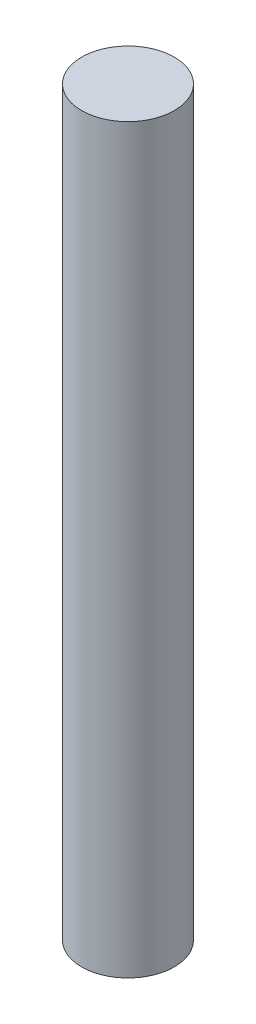
ISO-10303-21;
HEADER;
FILE_DESCRIPTION(('STEP AP214'),'2;1');
FILE_NAME('part.step','',(''),(''),'','','');
FILE_SCHEMA(('AUTOMOTIVE_DESIGN { 1 0 10303 214 1 1 1 1 }'));
ENDSEC;
DATA;
#1=APPLICATION_CONTEXT('core data for automotive mechanical design processes');
#2=APPLICATION_PROTOCOL_DEFINITION('international standard','automotive_design',2000,#1);
#3=PRODUCT_CONTEXT('',#1,'mechanical');
#4=PRODUCT('Part','Part','',(#3));
#5=PRODUCT_RELATED_PRODUCT_CATEGORY('part','',(#4));
#6=PRODUCT_DEFINITION_FORMATION('','',#4);
#7=PRODUCT_DEFINITION_CONTEXT('part definition',#1,'design');
#8=PRODUCT_DEFINITION('design','',#6,#7);
#9=PRODUCT_DEFINITION_SHAPE('','',#8);
#10=(LENGTH_UNIT() NAMED_UNIT(*) SI_UNIT(.MILLI.,.METRE.));
#11=(NAMED_UNIT(*) PLANE_ANGLE_UNIT() SI_UNIT($,.RADIAN.));
#12=(NAMED_UNIT(*) SI_UNIT($,.STERADIAN.) SOLID_ANGLE_UNIT());
#13=UNCERTAINTY_MEASURE_WITH_UNIT(LENGTH_MEASURE(1.E-05),#10,'distance_accuracy_value','');
#14=(GEOMETRIC_REPRESENTATION_CONTEXT(3) GLOBAL_UNCERTAINTY_ASSIGNED_CONTEXT((#13)) GLOBAL_UNIT_ASSIGNED_CONTEXT((#10,
#11,#12)) REPRESENTATION_CONTEXT('',''));
#15=CARTESIAN_POINT('',(0.,0.,0.));
#16=DIRECTION('',(0.,0.,1.));
#17=DIRECTION('',(1.,0.,0.));
#18=AXIS2_PLACEMENT_3D('',#15,#16,#17);
#19=CARTESIAN_POINT('',(0.,38.1,0.));
#20=DIRECTION('',(0.,-1.,0.));
#21=DIRECTION('',(0.,0.,-1.));
#22=AXIS2_PLACEMENT_3D('',#19,#20,#21);
#23=CYLINDRICAL_SURFACE('',#22,4.7625);
#24=CARTESIAN_POINT('',(0.,38.1,0.));
#25=DIRECTION('',(0.,1.,0.));
#26=DIRECTION('',(0.,0.,1.));
#27=AXIS2_PLACEMENT_3D('',#24,#25,#26);
#28=CIRCLE('',#27,4.7625);
#29=CARTESIAN_POINT('',(0.,38.1,4.7625));
#30=VERTEX_POINT('',#29);
#31=EDGE_CURVE('E10',#30,#30,#28,.T.);
#32=ORIENTED_EDGE('',*,*,#31,.F.);
#33=EDGE_LOOP('',(#32));
#34=FACE_BOUND('',#33,.T.);
#35=CARTESIAN_POINT('',(0.,-38.1,0.));
#36=DIRECTION('',(0.,1.,0.));
#37=DIRECTION('',(0.,0.,1.));
#38=AXIS2_PLACEMENT_3D('',#35,#36,#37);
#39=CIRCLE('',#38,4.7625);
#40=CARTESIAN_POINT('',(0.,-38.1,4.7625));
#41=VERTEX_POINT('',#40);
#42=EDGE_CURVE('E36',#41,#41,#39,.T.);
#43=ORIENTED_EDGE('',*,*,#42,.T.);
#44=EDGE_LOOP('',(#43));
#45=FACE_BOUND('',#44,.T.);
#46=ADVANCED_FACE('F33',(#34,#45),#23,.T.);
#47=CARTESIAN_POINT('',(0.,38.1,0.));
#48=DIRECTION('',(0.,1.,0.));
#49=DIRECTION('',(0.,0.,1.));
#50=AXIS2_PLACEMENT_3D('',#47,#48,#49);
#51=PLANE('',#50);
#52=ORIENTED_EDGE('',*,*,#31,.T.);
#53=EDGE_LOOP('',(#52));
#54=FACE_BOUND('',#53,.T.);
#55=ADVANCED_FACE('F62',(#54),#51,.T.);
#56=CARTESIAN_POINT('',(0.,-38.1,0.));
#57=DIRECTION('',(0.,1.,0.));
#58=DIRECTION('',(0.,0.,1.));
#59=AXIS2_PLACEMENT_3D('',#56,#57,#58);
#60=PLANE('',#59);
#61=CARTESIAN_POINT('',(0.,-38.1,0.));
#62=DIRECTION('',(0.,-1.,0.));
#63=DIRECTION('',(0.,0.,-1.));
#64=AXIS2_PLACEMENT_3D('',#61,#62,#63);
#65=CIRCLE('',#64,3.175);
#66=CARTESIAN_POINT('',(0.,-38.1,-3.175));
#67=VERTEX_POINT('',#66);
#68=EDGE_CURVE('E45',#67,#67,#65,.T.);
#69=ORIENTED_EDGE('',*,*,#68,.F.);
#70=EDGE_LOOP('',(#69));
#71=FACE_BOUND('',#70,.T.);
#72=ORIENTED_EDGE('',*,*,#42,.F.);
#73=EDGE_LOOP('',(#72));
#74=FACE_BOUND('',#73,.T.);
#75=ADVANCED_FACE('F56',(#71,#74),#60,.F.);
#76=CARTESIAN_POINT('',(0.,-31.75,0.));
#77=DIRECTION('',(0.,-1.,0.));
#78=DIRECTION('',(0.,0.,-1.));
#79=AXIS2_PLACEMENT_3D('',#76,#77,#78);
#80=CYLINDRICAL_SURFACE('',#79,3.175);
#81=CARTESIAN_POINT('',(0.,-31.75,0.));
#82=DIRECTION('',(0.,-1.,0.));
#83=DIRECTION('',(0.,0.,-1.));
#84=AXIS2_PLACEMENT_3D('',#81,#82,#83);
#85=CIRCLE('',#84,3.175);
#86=CARTESIAN_POINT('',(0.,-31.75,-3.175));
#87=VERTEX_POINT('',#86);
#88=EDGE_CURVE('E43',#87,#87,#85,.T.);
#89=ORIENTED_EDGE('',*,*,#88,.F.);
#90=EDGE_LOOP('',(#89));
#91=FACE_BOUND('',#90,.T.);
#92=ORIENTED_EDGE('',*,*,#68,.T.);
#93=EDGE_LOOP('',(#92));
#94=FACE_BOUND('',#93,.T.);
#95=ADVANCED_FACE('F53',(#91,#94),#80,.F.);
#96=CARTESIAN_POINT('',(0.,-31.75,0.));
#97=DIRECTION('',(0.,-1.,0.));
#98=DIRECTION('',(0.,0.,-1.));
#99=AXIS2_PLACEMENT_3D('',#96,#97,#98);
#100=PLANE('',#99);
#101=ORIENTED_EDGE('',*,*,#88,.T.);
#102=EDGE_LOOP('',(#101));
#103=FACE_BOUND('',#102,.T.);
#104=ADVANCED_FACE('F51',(#103),#100,.T.);
#105=CLOSED_SHELL('',(#46,#55,#75,#95,#104));
#106=MANIFOLD_SOLID_BREP('B2',#105);
#107=ADVANCED_BREP_SHAPE_REPRESENTATION('',(#18,#106),#14);
#108=SHAPE_DEFINITION_REPRESENTATION(#9,#107);
ENDSEC;
END-ISO-10303-21;
